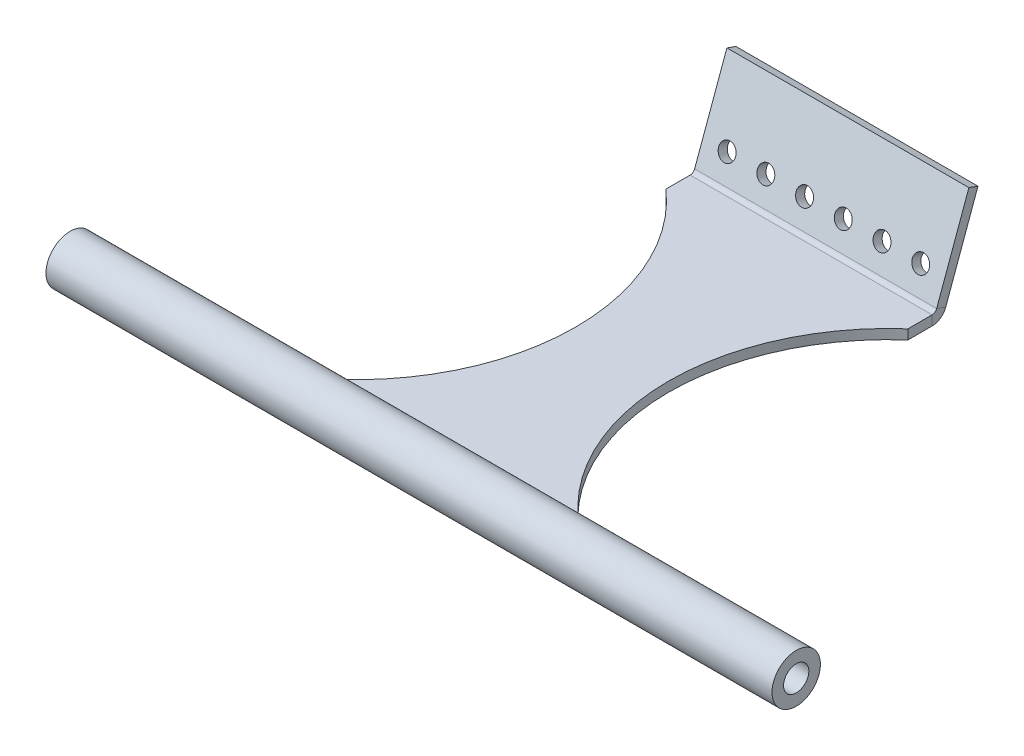
ISO-10303-21;
HEADER;
FILE_DESCRIPTION(('STEP AP214'),'2;1');
FILE_NAME('part.step','',(''),(''),'','','');
FILE_SCHEMA(('AUTOMOTIVE_DESIGN { 1 0 10303 214 1 1 1 1 }'));
ENDSEC;
DATA;
#1=APPLICATION_CONTEXT('core data for automotive mechanical design processes');
#2=APPLICATION_PROTOCOL_DEFINITION('international standard','automotive_design',2000,#1);
#3=PRODUCT_CONTEXT('',#1,'mechanical');
#4=PRODUCT('Part','Part','',(#3));
#5=PRODUCT_RELATED_PRODUCT_CATEGORY('part','',(#4));
#6=PRODUCT_DEFINITION_FORMATION('','',#4);
#7=PRODUCT_DEFINITION_CONTEXT('part definition',#1,'design');
#8=PRODUCT_DEFINITION('design','',#6,#7);
#9=PRODUCT_DEFINITION_SHAPE('','',#8);
#10=(LENGTH_UNIT() NAMED_UNIT(*) SI_UNIT(.MILLI.,.METRE.));
#11=(NAMED_UNIT(*) PLANE_ANGLE_UNIT() SI_UNIT($,.RADIAN.));
#12=(NAMED_UNIT(*) SI_UNIT($,.STERADIAN.) SOLID_ANGLE_UNIT());
#13=UNCERTAINTY_MEASURE_WITH_UNIT(LENGTH_MEASURE(1.E-05),#10,'distance_accuracy_value','');
#14=(GEOMETRIC_REPRESENTATION_CONTEXT(3) GLOBAL_UNCERTAINTY_ASSIGNED_CONTEXT((#13)) GLOBAL_UNIT_ASSIGNED_CONTEXT((#10,
#11,#12)) REPRESENTATION_CONTEXT('',''));
#15=CARTESIAN_POINT('',(0.,0.,0.));
#16=DIRECTION('',(0.,0.,1.));
#17=DIRECTION('',(1.,0.,0.));
#18=AXIS2_PLACEMENT_3D('',#15,#16,#17);
#19=CARTESIAN_POINT('',(25.,-2.,-50.));
#20=DIRECTION('',(1.,0.,0.));
#21=DIRECTION('',(0.,0.,-1.));
#22=AXIS2_PLACEMENT_3D('',#19,#20,#21);
#23=PLANE('',#22);
#24=CARTESIAN_POINT('',(25.,-1.,50.));
#25=DIRECTION('',(1.,0.,0.));
#26=DIRECTION('',(0.,0.,-1.));
#27=AXIS2_PLACEMENT_3D('',#24,#25,#26);
#28=CIRCLE('',#27,5.);
#29=CARTESIAN_POINT('',(25.,-1.,45.));
#30=VERTEX_POINT('',#29);
#31=CARTESIAN_POINT('',(25.,0.,45.1010205144336));
#32=VERTEX_POINT('',#31);
#33=EDGE_CURVE('E179',#30,#32,#28,.T.);
#34=ORIENTED_EDGE('',*,*,#33,.F.);
#35=DIRECTION('',(0.,-1.,0.));
#36=VECTOR('',#35,1.);
#37=CARTESIAN_POINT('',(25.,18.9625246801192,45.));
#38=LINE('',#37,#36);
#39=CARTESIAN_POINT('',(25.,0.,45.));
#40=VERTEX_POINT('',#39);
#41=EDGE_CURVE('E187',#40,#30,#38,.T.);
#42=ORIENTED_EDGE('',*,*,#41,.F.);
#43=DIRECTION('',(0.,0.,-1.));
#44=VECTOR('',#43,1.);
#45=CARTESIAN_POINT('',(25.,0.,-50.));
#46=LINE('',#45,#44);
#47=EDGE_CURVE('E217',#32,#40,#46,.T.);
#48=ORIENTED_EDGE('',*,*,#47,.F.);
#49=EDGE_LOOP('',(#34,#42,#48));
#50=FACE_BOUND('',#49,.T.);
#51=ADVANCED_FACE('F47',(#50),#23,.T.);
#52=CARTESIAN_POINT('',(-25.,-2.,-50.));
#53=DIRECTION('',(-1.,0.,0.));
#54=DIRECTION('',(0.,0.,1.));
#55=AXIS2_PLACEMENT_3D('',#52,#53,#54);
#56=PLANE('',#55);
#57=CARTESIAN_POINT('',(-25.,-1.,50.));
#58=DIRECTION('',(-1.,0.,0.));
#59=DIRECTION('',(0.,0.,1.));
#60=AXIS2_PLACEMENT_3D('',#57,#58,#59);
#61=CIRCLE('',#60,5.);
#62=CARTESIAN_POINT('',(-25.,0.,45.1010205144336));
#63=VERTEX_POINT('',#62);
#64=CARTESIAN_POINT('',(-25.,-1.,45.));
#65=VERTEX_POINT('',#64);
#66=EDGE_CURVE('E169',#63,#65,#61,.T.);
#67=ORIENTED_EDGE('',*,*,#66,.F.);
#68=DIRECTION('',(0.,0.,1.));
#69=VECTOR('',#68,1.);
#70=CARTESIAN_POINT('',(-25.,0.,-50.));
#71=LINE('',#70,#69);
#72=CARTESIAN_POINT('',(-25.,0.,45.));
#73=VERTEX_POINT('',#72);
#74=EDGE_CURVE('E213',#73,#63,#71,.T.);
#75=ORIENTED_EDGE('',*,*,#74,.F.);
#76=DIRECTION('',(0.,-1.,0.));
#77=VECTOR('',#76,1.);
#78=CARTESIAN_POINT('',(-25.,18.9625246801192,45.));
#79=LINE('',#78,#77);
#80=EDGE_CURVE('E252',#65,#73,#79,.F.);
#81=ORIENTED_EDGE('',*,*,#80,.F.);
#82=EDGE_LOOP('',(#67,#75,#81));
#83=FACE_BOUND('',#82,.T.);
#84=ADVANCED_FACE('F332',(#83),#56,.T.);
#85=CARTESIAN_POINT('',(25.,-2.,45.1010205144336));
#86=VERTEX_POINT('',#85);
#87=EDGE_CURVE('E64',#86,#30,#28,.T.);
#88=ORIENTED_EDGE('',*,*,#87,.F.);
#89=DIRECTION('',(0.,0.,-1.));
#90=VECTOR('',#89,1.);
#91=CARTESIAN_POINT('',(25.,-2.,-50.));
#92=LINE('',#91,#90);
#93=CARTESIAN_POINT('',(25.,-2.,45.));
#94=VERTEX_POINT('',#93);
#95=EDGE_CURVE('E163',#86,#94,#92,.T.);
#96=ORIENTED_EDGE('',*,*,#95,.T.);
#97=EDGE_CURVE('E190',#30,#94,#38,.T.);
#98=ORIENTED_EDGE('',*,*,#97,.F.);
#99=EDGE_LOOP('',(#88,#96,#98));
#100=FACE_BOUND('',#99,.T.);
#101=ADVANCED_FACE('F335',(#100),#23,.T.);
#102=DIRECTION('',(0.,-1.,0.));
#103=VECTOR('',#102,1.);
#104=CARTESIAN_POINT('',(-25.,18.9625246801192,-23.0772493108089));
#105=LINE('',#104,#103);
#106=CARTESIAN_POINT('',(-25.,0.,-23.0772493108089));
#107=VERTEX_POINT('',#106);
#108=CARTESIAN_POINT('',(-25.,-2.,-23.0772493108089));
#109=VERTEX_POINT('',#108);
#110=EDGE_CURVE('E56',#107,#109,#105,.T.);
#111=ORIENTED_EDGE('',*,*,#110,.F.);
#112=CARTESIAN_POINT('',(-25.,0.,-28.0772493108089));
#113=VERTEX_POINT('',#112);
#114=EDGE_CURVE('E210',#113,#107,#71,.T.);
#115=ORIENTED_EDGE('',*,*,#114,.F.);
#116=DIRECTION('',(0.,-1.,0.));
#117=VECTOR('',#116,1.);
#118=CARTESIAN_POINT('',(-25.,-2.,-28.0772493108089));
#119=LINE('',#118,#117);
#120=CARTESIAN_POINT('',(-25.,-2.,-28.0772493108089));
#121=VERTEX_POINT('',#120);
#122=EDGE_CURVE('E157',#113,#121,#119,.T.);
#123=ORIENTED_EDGE('',*,*,#122,.T.);
#124=DIRECTION('',(0.,0.,1.));
#125=VECTOR('',#124,1.);
#126=CARTESIAN_POINT('',(-25.,-2.,-50.));
#127=LINE('',#126,#125);
#128=EDGE_CURVE('E156',#121,#109,#127,.T.);
#129=ORIENTED_EDGE('',*,*,#128,.T.);
#130=EDGE_LOOP('',(#111,#115,#123,#129));
#131=FACE_BOUND('',#130,.T.);
#132=ADVANCED_FACE('F342',(#131),#56,.T.);
#133=CARTESIAN_POINT('',(0.,-28.7061466458276,-20.4576294744087));
#134=DIRECTION('',(0.,0.342020143325666,0.93969262078591));
#135=DIRECTION('',(0.,-0.93969262078591,0.342020143325666));
#136=AXIS2_PLACEMENT_3D('',#133,#134,#135);
#137=PLANE('',#136);
#138=CARTESIAN_POINT('',(20.,4.67240267395255,-32.606427889795));
#139=DIRECTION('',(0.,-0.342020143325666,-0.939692620785909));
#140=DIRECTION('',(0.,0.939692620785909,-0.342020143325666));
#141=AXIS2_PLACEMENT_3D('',#138,#139,#140);
#142=CIRCLE('',#141,1.75);
#143=CARTESIAN_POINT('',(20.,6.31686476032789,-33.2049631406149));
#144=VERTEX_POINT('',#143);
#145=EDGE_CURVE('E263',#144,#144,#142,.T.);
#146=ORIENTED_EDGE('',*,*,#145,.F.);
#147=EDGE_LOOP('',(#146));
#148=FACE_BOUND('',#147,.T.);
#149=CARTESIAN_POINT('',(12.,4.67240267395255,-32.606427889795));
#150=DIRECTION('',(0.,-0.342020143325666,-0.939692620785909));
#151=DIRECTION('',(0.,0.939692620785909,-0.342020143325666));
#152=AXIS2_PLACEMENT_3D('',#149,#150,#151);
#153=CIRCLE('',#152,1.75);
#154=CARTESIAN_POINT('',(12.,6.31686476032789,-33.2049631406149));
#155=VERTEX_POINT('',#154);
#156=EDGE_CURVE('E295',#155,#155,#153,.T.);
#157=ORIENTED_EDGE('',*,*,#156,.F.);
#158=EDGE_LOOP('',(#157));
#159=FACE_BOUND('',#158,.T.);
#160=CARTESIAN_POINT('',(3.99999999999999,4.67240267395255,-32.606427889795));
#161=DIRECTION('',(0.,-0.342020143325666,-0.939692620785909));
#162=DIRECTION('',(0.,0.939692620785909,-0.342020143325666));
#163=AXIS2_PLACEMENT_3D('',#160,#161,#162);
#164=CIRCLE('',#163,1.75);
#165=CARTESIAN_POINT('',(3.99999999999999,6.31686476032789,-33.2049631406149));
#166=VERTEX_POINT('',#165);
#167=EDGE_CURVE('E292',#166,#166,#164,.T.);
#168=ORIENTED_EDGE('',*,*,#167,.F.);
#169=EDGE_LOOP('',(#168));
#170=FACE_BOUND('',#169,.T.);
#171=CARTESIAN_POINT('',(-4.00000000000001,4.67240267395255,-32.606427889795));
#172=DIRECTION('',(0.,-0.342020143325666,-0.939692620785909));
#173=DIRECTION('',(0.,0.939692620785909,-0.342020143325666));
#174=AXIS2_PLACEMENT_3D('',#171,#172,#173);
#175=CIRCLE('',#174,1.75);
#176=CARTESIAN_POINT('',(-4.00000000000001,6.31686476032789,-33.2049631406149));
#177=VERTEX_POINT('',#176);
#178=EDGE_CURVE('E289',#177,#177,#175,.T.);
#179=ORIENTED_EDGE('',*,*,#178,.F.);
#180=EDGE_LOOP('',(#179));
#181=FACE_BOUND('',#180,.T.);
#182=CARTESIAN_POINT('',(-12.,4.67240267395255,-32.606427889795));
#183=DIRECTION('',(0.,-0.342020143325666,-0.939692620785909));
#184=DIRECTION('',(0.,0.939692620785909,-0.342020143325666));
#185=AXIS2_PLACEMENT_3D('',#182,#183,#184);
#186=CIRCLE('',#185,1.75);
#187=CARTESIAN_POINT('',(-12.,6.31686476032789,-33.2049631406149));
#188=VERTEX_POINT('',#187);
#189=EDGE_CURVE('E285',#188,#188,#186,.T.);
#190=ORIENTED_EDGE('',*,*,#189,.F.);
#191=EDGE_LOOP('',(#190));
#192=FACE_BOUND('',#191,.T.);
#193=CARTESIAN_POINT('',(-20.,4.67240267395255,-32.606427889795));
#194=DIRECTION('',(0.,-0.342020143325666,-0.939692620785909));
#195=DIRECTION('',(0.,0.939692620785909,-0.342020143325666));
#196=AXIS2_PLACEMENT_3D('',#193,#194,#195);
#197=CIRCLE('',#196,1.75);
#198=CARTESIAN_POINT('',(-20.,6.31686476032789,-33.2049631406149));
#199=VERTEX_POINT('',#198);
#200=EDGE_CURVE('E282',#199,#199,#197,.T.);
#201=ORIENTED_EDGE('',*,*,#200,.F.);
#202=EDGE_LOOP('',(#201));
#203=FACE_BOUND('',#202,.T.);
#204=DIRECTION('',(0.,0.93969262078591,-0.342020143325666));
#205=VECTOR('',#204,1.);
#206=CARTESIAN_POINT('',(25.,18.2784843934679,-37.558636640692));
#207=LINE('',#206,#205);
#208=CARTESIAN_POINT('',(25.,-0.0260604299769963,-30.8963271731667));
#209=VERTEX_POINT('',#208);
#210=CARTESIAN_POINT('',(25.,18.2784843934679,-37.558636640692));
#211=VERTEX_POINT('',#210);
#212=EDGE_CURVE('E230',#209,#211,#207,.T.);
#213=ORIENTED_EDGE('',*,*,#212,.F.);
#214=DIRECTION('',(-1.,0.,0.));
#215=VECTOR('',#214,1.);
#216=CARTESIAN_POINT('',(0.,-0.0260604299769963,-30.8963271731667));
#217=LINE('',#216,#215);
#218=CARTESIAN_POINT('',(-25.,-0.026060429976997,-30.8963271731667));
#219=VERTEX_POINT('',#218);
#220=EDGE_CURVE('E237',#209,#219,#217,.T.);
#221=ORIENTED_EDGE('',*,*,#220,.T.);
#222=DIRECTION('',(0.,-0.93969262078591,0.342020143325666));
#223=VECTOR('',#222,1.);
#224=CARTESIAN_POINT('',(-25.,18.2784843934679,-37.558636640692));
#225=LINE('',#224,#223);
#226=CARTESIAN_POINT('',(-25.,18.2784843934679,-37.558636640692));
#227=VERTEX_POINT('',#226);
#228=EDGE_CURVE('E229',#227,#219,#225,.T.);
#229=ORIENTED_EDGE('',*,*,#228,.F.);
#230=DIRECTION('',(-1.,0.,0.));
#231=VECTOR('',#230,1.);
#232=CARTESIAN_POINT('',(-25.,18.2784843934679,-37.558636640692));
#233=LINE('',#232,#231);
#234=EDGE_CURVE('E226',#211,#227,#233,.T.);
#235=ORIENTED_EDGE('',*,*,#234,.F.);
#236=EDGE_LOOP('',(#213,#221,#229,#235));
#237=FACE_BOUND('',#236,.T.);
#238=ADVANCED_FACE('F374',(#148,#159,#170,#181,#192,#203,#237),#137,.F.);
#239=CARTESIAN_POINT('',(25.,18.2784843934679,-37.558636640692));
#240=DIRECTION('',(1.,0.,0.));
#241=DIRECTION('',(0.,0.93969262078591,-0.342020143325666));
#242=AXIS2_PLACEMENT_3D('',#239,#240,#241);
#243=PLANE('',#242);
#244=DIRECTION('',(0.,0.342020143325666,0.93969262078591));
#245=VECTOR('',#244,1.);
#246=CARTESIAN_POINT('',(25.,-0.0260604299769963,-30.8963271731667));
#247=LINE('',#246,#245);
#248=CARTESIAN_POINT('',(25.,0.657979856674335,-29.0169419315948));
#249=VERTEX_POINT('',#248);
#250=EDGE_CURVE('E243',#209,#249,#247,.T.);
#251=ORIENTED_EDGE('',*,*,#250,.F.);
#252=ORIENTED_EDGE('',*,*,#212,.T.);
#253=DIRECTION('',(0.,0.342020143325666,0.93969262078591));
#254=VECTOR('',#253,1.);
#255=CARTESIAN_POINT('',(25.,18.2784843934679,-37.558636640692));
#256=LINE('',#255,#254);
#257=CARTESIAN_POINT('',(25.,18.9625246801192,-35.6792513991202));
#258=VERTEX_POINT('',#257);
#259=EDGE_CURVE('E238',#211,#258,#256,.T.);
#260=ORIENTED_EDGE('',*,*,#259,.T.);
#261=DIRECTION('',(0.,0.93969262078591,-0.342020143325666));
#262=VECTOR('',#261,1.);
#263=CARTESIAN_POINT('',(25.,18.9625246801192,-35.6792513991202));
#264=LINE('',#263,#262);
#265=EDGE_CURVE('E207',#249,#258,#264,.T.);
#266=ORIENTED_EDGE('',*,*,#265,.F.);
#267=EDGE_LOOP('',(#251,#252,#260,#266));
#268=FACE_BOUND('',#267,.T.);
#269=ADVANCED_FACE('F378',(#268),#243,.T.);
#270=CARTESIAN_POINT('',(-25.,18.2784843934679,-37.558636640692));
#271=DIRECTION('',(-1.,0.,0.));
#272=DIRECTION('',(0.,-0.93969262078591,0.342020143325666));
#273=AXIS2_PLACEMENT_3D('',#270,#271,#272);
#274=PLANE('',#273);
#275=DIRECTION('',(0.,-0.342020143325666,-0.93969262078591));
#276=VECTOR('',#275,1.);
#277=CARTESIAN_POINT('',(-25.,-0.0260604299769963,-30.8963271731667));
#278=LINE('',#277,#276);
#279=CARTESIAN_POINT('',(-25.,0.657979856674335,-29.0169419315948));
#280=VERTEX_POINT('',#279);
#281=EDGE_CURVE('E249',#280,#219,#278,.T.);
#282=ORIENTED_EDGE('',*,*,#281,.F.);
#283=DIRECTION('',(0.,-0.93969262078591,0.342020143325666));
#284=VECTOR('',#283,1.);
#285=CARTESIAN_POINT('',(-25.,18.9625246801192,-35.6792513991202));
#286=LINE('',#285,#284);
#287=CARTESIAN_POINT('',(-25.,18.9625246801192,-35.6792513991202));
#288=VERTEX_POINT('',#287);
#289=EDGE_CURVE('E234',#288,#280,#286,.T.);
#290=ORIENTED_EDGE('',*,*,#289,.F.);
#291=DIRECTION('',(0.,0.342020143325666,0.93969262078591));
#292=VECTOR('',#291,1.);
#293=CARTESIAN_POINT('',(-25.,18.2784843934679,-37.558636640692));
#294=LINE('',#293,#292);
#295=EDGE_CURVE('E235',#227,#288,#294,.T.);
#296=ORIENTED_EDGE('',*,*,#295,.F.);
#297=ORIENTED_EDGE('',*,*,#228,.T.);
#298=EDGE_LOOP('',(#282,#290,#296,#297));
#299=FACE_BOUND('',#298,.T.);
#300=ADVANCED_FACE('F49',(#299),#274,.T.);
#301=CARTESIAN_POINT('',(-25.,18.2784843934679,-37.558636640692));
#302=DIRECTION('',(0.,0.93969262078591,-0.342020143325666));
#303=DIRECTION('',(-1.,0.,0.));
#304=AXIS2_PLACEMENT_3D('',#301,#302,#303);
#305=PLANE('',#304);
#306=DIRECTION('',(-1.,0.,0.));
#307=VECTOR('',#306,1.);
#308=CARTESIAN_POINT('',(-25.,18.9625246801192,-35.6792513991202));
#309=LINE('',#308,#307);
#310=EDGE_CURVE('E231',#258,#288,#309,.T.);
#311=ORIENTED_EDGE('',*,*,#310,.F.);
#312=ORIENTED_EDGE('',*,*,#259,.F.);
#313=ORIENTED_EDGE('',*,*,#234,.T.);
#314=ORIENTED_EDGE('',*,*,#295,.T.);
#315=EDGE_LOOP('',(#311,#312,#313,#314));
#316=FACE_BOUND('',#315,.T.);
#317=ADVANCED_FACE('F424',(#316),#305,.T.);
#318=CARTESIAN_POINT('',(0.,-28.0221063591763,-18.5782442328369));
#319=DIRECTION('',(0.,0.342020143325666,0.93969262078591));
#320=DIRECTION('',(0.,-0.93969262078591,0.342020143325666));
#321=AXIS2_PLACEMENT_3D('',#318,#319,#320);
#322=PLANE('',#321);
#323=CARTESIAN_POINT('',(20.,5.35644296060388,-30.7270426482232));
#324=DIRECTION('',(0.,0.342020143325666,0.93969262078591));
#325=DIRECTION('',(0.,-0.939692620785909,0.342020143325666));
#326=AXIS2_PLACEMENT_3D('',#323,#324,#325);
#327=CIRCLE('',#326,1.75);
#328=CARTESIAN_POINT('',(20.,3.71198087422854,-30.1285073974033));
#329=VERTEX_POINT('',#328);
#330=EDGE_CURVE('E51',#329,#329,#327,.T.);
#331=ORIENTED_EDGE('',*,*,#330,.F.);
#332=EDGE_LOOP('',(#331));
#333=FACE_BOUND('',#332,.T.);
#334=CARTESIAN_POINT('',(12.,5.35644296060388,-30.7270426482232));
#335=DIRECTION('',(0.,0.342020143325666,0.93969262078591));
#336=DIRECTION('',(0.,-0.939692620785909,0.342020143325666));
#337=AXIS2_PLACEMENT_3D('',#334,#335,#336);
#338=CIRCLE('',#337,1.75);
#339=CARTESIAN_POINT('',(12.,3.71198087422854,-30.1285073974033));
#340=VERTEX_POINT('',#339);
#341=EDGE_CURVE('E271',#340,#340,#338,.T.);
#342=ORIENTED_EDGE('',*,*,#341,.F.);
#343=EDGE_LOOP('',(#342));
#344=FACE_BOUND('',#343,.T.);
#345=CARTESIAN_POINT('',(3.99999999999999,5.35644296060388,-30.7270426482232));
#346=DIRECTION('',(0.,0.342020143325666,0.93969262078591));
#347=DIRECTION('',(0.,-0.939692620785909,0.342020143325666));
#348=AXIS2_PLACEMENT_3D('',#345,#346,#347);
#349=CIRCLE('',#348,1.75);
#350=CARTESIAN_POINT('',(3.99999999999999,3.71198087422854,-30.1285073974033));
#351=VERTEX_POINT('',#350);
#352=EDGE_CURVE('E269',#351,#351,#349,.T.);
#353=ORIENTED_EDGE('',*,*,#352,.F.);
#354=EDGE_LOOP('',(#353));
#355=FACE_BOUND('',#354,.T.);
#356=CARTESIAN_POINT('',(-4.00000000000001,5.35644296060388,-30.7270426482232));
#357=DIRECTION('',(0.,0.342020143325666,0.93969262078591));
#358=DIRECTION('',(0.,-0.939692620785909,0.342020143325666));
#359=AXIS2_PLACEMENT_3D('',#356,#357,#358);
#360=CIRCLE('',#359,1.75);
#361=CARTESIAN_POINT('',(-4.00000000000001,3.71198087422854,-30.1285073974033));
#362=VERTEX_POINT('',#361);
#363=EDGE_CURVE('E266',#362,#362,#360,.T.);
#364=ORIENTED_EDGE('',*,*,#363,.F.);
#365=EDGE_LOOP('',(#364));
#366=FACE_BOUND('',#365,.T.);
#367=CARTESIAN_POINT('',(-12.,5.35644296060389,-30.7270426482232));
#368=DIRECTION('',(0.,0.342020143325666,0.93969262078591));
#369=DIRECTION('',(0.,-0.939692620785909,0.342020143325666));
#370=AXIS2_PLACEMENT_3D('',#367,#368,#369);
#371=CIRCLE('',#370,1.75);
#372=CARTESIAN_POINT('',(-12.,3.71198087422855,-30.1285073974033));
#373=VERTEX_POINT('',#372);
#374=EDGE_CURVE('E262',#373,#373,#371,.T.);
#375=ORIENTED_EDGE('',*,*,#374,.F.);
#376=EDGE_LOOP('',(#375));
#377=FACE_BOUND('',#376,.T.);
#378=CARTESIAN_POINT('',(-20.,5.35644296060389,-30.7270426482232));
#379=DIRECTION('',(0.,0.342020143325666,0.93969262078591));
#380=DIRECTION('',(0.,-0.939692620785909,0.342020143325666));
#381=AXIS2_PLACEMENT_3D('',#378,#379,#380);
#382=CIRCLE('',#381,1.75);
#383=CARTESIAN_POINT('',(-20.,3.71198087422855,-30.1285073974033));
#384=VERTEX_POINT('',#383);
#385=EDGE_CURVE('E259',#384,#384,#382,.T.);
#386=ORIENTED_EDGE('',*,*,#385,.F.);
#387=EDGE_LOOP('',(#386));
#388=FACE_BOUND('',#387,.T.);
#389=DIRECTION('',(-1.,0.,0.));
#390=VECTOR('',#389,1.);
#391=CARTESIAN_POINT('',(0.,0.657979856674335,-29.0169419315948));
#392=LINE('',#391,#390);
#393=EDGE_CURVE('E246',#249,#280,#392,.T.);
#394=ORIENTED_EDGE('',*,*,#393,.F.);
#395=ORIENTED_EDGE('',*,*,#265,.T.);
#396=ORIENTED_EDGE('',*,*,#310,.T.);
#397=ORIENTED_EDGE('',*,*,#289,.T.);
#398=EDGE_LOOP('',(#394,#395,#396,#397));
#399=FACE_BOUND('',#398,.T.);
#400=ADVANCED_FACE('F353',(#333,#344,#355,#366,#377,#388,#399),#322,.T.);
#401=CARTESIAN_POINT('',(0.,-2.,0.));
#402=DIRECTION('',(0.,1.,0.));
#403=DIRECTION('',(0.,0.,1.));
#404=AXIS2_PLACEMENT_3D('',#401,#402,#403);
#405=PLANE('',#404);
#406=ORIENTED_EDGE('',*,*,#95,.F.);
#407=DIRECTION('',(1.,0.,0.));
#408=VECTOR('',#407,1.);
#409=CARTESIAN_POINT('',(-75.,-2.,45.1010205144336));
#410=LINE('',#409,#408);
#411=CARTESIAN_POINT('',(-25.,-2.,45.1010205144336));
#412=VERTEX_POINT('',#411);
#413=EDGE_CURVE('E160',#86,#412,#410,.F.);
#414=ORIENTED_EDGE('',*,*,#413,.T.);
#415=CARTESIAN_POINT('',(-25.,-2.,45.));
#416=VERTEX_POINT('',#415);
#417=EDGE_CURVE('E146',#416,#412,#127,.T.);
#418=ORIENTED_EDGE('',*,*,#417,.F.);
#419=CARTESIAN_POINT('',(-55.,-2.,10.9613753445955));
#420=DIRECTION('',(0.,-1.,0.));
#421=DIRECTION('',(0.,0.,1.));
#422=AXIS2_PLACEMENT_3D('',#419,#420,#421);
#423=CIRCLE('',#422,45.3721056204306);
#424=EDGE_CURVE('E180',#109,#416,#423,.T.);
#425=ORIENTED_EDGE('',*,*,#424,.F.);
#426=ORIENTED_EDGE('',*,*,#128,.F.);
#427=DIRECTION('',(-1.,0.,0.));
#428=VECTOR('',#427,1.);
#429=CARTESIAN_POINT('',(0.,-2.,-28.0772493108089));
#430=LINE('',#429,#428);
#431=CARTESIAN_POINT('',(25.,-2.,-28.0772493108089));
#432=VERTEX_POINT('',#431);
#433=EDGE_CURVE('E201',#432,#121,#430,.T.);
#434=ORIENTED_EDGE('',*,*,#433,.F.);
#435=CARTESIAN_POINT('',(25.,-2.,-23.0772493108089));
#436=VERTEX_POINT('',#435);
#437=EDGE_CURVE('E224',#436,#432,#92,.T.);
#438=ORIENTED_EDGE('',*,*,#437,.F.);
#439=CARTESIAN_POINT('',(55.,-2.,10.9613753445955));
#440=DIRECTION('',(0.,-1.,0.));
#441=DIRECTION('',(0.,0.,-1.));
#442=AXIS2_PLACEMENT_3D('',#439,#440,#441);
#443=CIRCLE('',#442,45.3721056204306);
#444=EDGE_CURVE('E183',#94,#436,#443,.T.);
#445=ORIENTED_EDGE('',*,*,#444,.F.);
#446=EDGE_LOOP('',(#406,#414,#418,#425,#426,#434,#438,#445));
#447=FACE_BOUND('',#446,.T.);
#448=ADVANCED_FACE('F161',(#447),#405,.F.);
#449=DIRECTION('',(0.,-1.,0.));
#450=VECTOR('',#449,1.);
#451=CARTESIAN_POINT('',(25.,18.9625246801192,-23.0772493108089));
#452=LINE('',#451,#450);
#453=CARTESIAN_POINT('',(25.,0.,-23.0772493108089));
#454=VERTEX_POINT('',#453);
#455=EDGE_CURVE('E184',#454,#436,#452,.T.);
#456=ORIENTED_EDGE('',*,*,#455,.T.);
#457=ORIENTED_EDGE('',*,*,#437,.T.);
#458=DIRECTION('',(0.,1.,0.));
#459=VECTOR('',#458,1.);
#460=CARTESIAN_POINT('',(25.,-2.,-28.0772493108089));
#461=LINE('',#460,#459);
#462=CARTESIAN_POINT('',(25.,0.,-28.0772493108089));
#463=VERTEX_POINT('',#462);
#464=EDGE_CURVE('E220',#432,#463,#461,.T.);
#465=ORIENTED_EDGE('',*,*,#464,.T.);
#466=EDGE_CURVE('E219',#454,#463,#46,.T.);
#467=ORIENTED_EDGE('',*,*,#466,.F.);
#468=EDGE_LOOP('',(#456,#457,#465,#467));
#469=FACE_BOUND('',#468,.T.);
#470=ADVANCED_FACE('F336',(#469),#23,.T.);
#471=CARTESIAN_POINT('',(0.,0.,0.));
#472=DIRECTION('',(0.,1.,0.));
#473=DIRECTION('',(0.,0.,1.));
#474=AXIS2_PLACEMENT_3D('',#471,#472,#473);
#475=PLANE('',#474);
#476=DIRECTION('',(1.,0.,0.));
#477=VECTOR('',#476,1.);
#478=CARTESIAN_POINT('',(-75.,0.,45.1010205144336));
#479=LINE('',#478,#477);
#480=EDGE_CURVE('E72',#32,#63,#479,.F.);
#481=ORIENTED_EDGE('',*,*,#480,.F.);
#482=ORIENTED_EDGE('',*,*,#47,.T.);
#483=CARTESIAN_POINT('',(55.,0.,10.9613753445955));
#484=DIRECTION('',(0.,1.,0.));
#485=DIRECTION('',(0.,0.,1.));
#486=AXIS2_PLACEMENT_3D('',#483,#484,#485);
#487=CIRCLE('',#486,45.3721056204306);
#488=EDGE_CURVE('E12',#454,#40,#487,.T.);
#489=ORIENTED_EDGE('',*,*,#488,.F.);
#490=ORIENTED_EDGE('',*,*,#466,.T.);
#491=DIRECTION('',(-1.,0.,0.));
#492=VECTOR('',#491,1.);
#493=CARTESIAN_POINT('',(0.,0.,-28.0772493108089));
#494=LINE('',#493,#492);
#495=EDGE_CURVE('E214',#463,#113,#494,.T.);
#496=ORIENTED_EDGE('',*,*,#495,.T.);
#497=ORIENTED_EDGE('',*,*,#114,.T.);
#498=CARTESIAN_POINT('',(-55.,0.,10.9613753445955));
#499=DIRECTION('',(0.,1.,0.));
#500=DIRECTION('',(0.,0.,1.));
#501=AXIS2_PLACEMENT_3D('',#498,#499,#500);
#502=CIRCLE('',#501,45.3721056204306);
#503=EDGE_CURVE('E182',#73,#107,#502,.T.);
#504=ORIENTED_EDGE('',*,*,#503,.F.);
#505=ORIENTED_EDGE('',*,*,#74,.T.);
#506=EDGE_LOOP('',(#481,#482,#489,#490,#496,#497,#504,#505));
#507=FACE_BOUND('',#506,.T.);
#508=ADVANCED_FACE('F347',(#507),#475,.T.);
#509=EDGE_CURVE('E150',#65,#412,#61,.T.);
#510=ORIENTED_EDGE('',*,*,#509,.F.);
#511=EDGE_CURVE('E153',#416,#65,#79,.F.);
#512=ORIENTED_EDGE('',*,*,#511,.F.);
#513=ORIENTED_EDGE('',*,*,#417,.T.);
#514=EDGE_LOOP('',(#510,#512,#513));
#515=FACE_BOUND('',#514,.T.);
#516=ADVANCED_FACE('F148',(#515),#56,.T.);
#517=CARTESIAN_POINT('',(25.,1.,-28.0772493108089));
#518=DIRECTION('',(1.,0.,0.));
#519=DIRECTION('',(0.,0.,-1.));
#520=AXIS2_PLACEMENT_3D('',#517,#518,#519);
#521=PLANE('',#520);
#522=ORIENTED_EDGE('',*,*,#250,.T.);
#523=CARTESIAN_POINT('',(25.,1.,-28.0772493108089));
#524=DIRECTION('',(1.,0.,0.));
#525=DIRECTION('',(0.,0.,-1.));
#526=AXIS2_PLACEMENT_3D('',#523,#524,#525);
#527=CIRCLE('',#526,1.);
#528=EDGE_CURVE('E193',#249,#463,#527,.F.);
#529=ORIENTED_EDGE('',*,*,#528,.T.);
#530=ORIENTED_EDGE('',*,*,#464,.F.);
#531=CARTESIAN_POINT('',(25.,1.,-28.0772493108089));
#532=DIRECTION('',(-1.,0.,0.));
#533=DIRECTION('',(0.,0.,-1.));
#534=AXIS2_PLACEMENT_3D('',#531,#532,#533);
#535=CIRCLE('',#534,3.);
#536=EDGE_CURVE('E194',#209,#432,#535,.T.);
#537=ORIENTED_EDGE('',*,*,#536,.F.);
#538=EDGE_LOOP('',(#522,#529,#530,#537));
#539=FACE_BOUND('',#538,.T.);
#540=ADVANCED_FACE('F382',(#539),#521,.T.);
#541=CARTESIAN_POINT('',(-25.,1.,-28.0772493108089));
#542=DIRECTION('',(-1.,0.,0.));
#543=DIRECTION('',(0.,0.,1.));
#544=AXIS2_PLACEMENT_3D('',#541,#542,#543);
#545=PLANE('',#544);
#546=ORIENTED_EDGE('',*,*,#122,.F.);
#547=CARTESIAN_POINT('',(-25.,1.,-28.0772493108089));
#548=DIRECTION('',(1.,0.,0.));
#549=DIRECTION('',(0.,0.,-1.));
#550=AXIS2_PLACEMENT_3D('',#547,#548,#549);
#551=CIRCLE('',#550,1.);
#552=EDGE_CURVE('E198',#113,#280,#551,.T.);
#553=ORIENTED_EDGE('',*,*,#552,.T.);
#554=ORIENTED_EDGE('',*,*,#281,.T.);
#555=CARTESIAN_POINT('',(-25.,1.,-28.0772493108089));
#556=DIRECTION('',(1.,0.,0.));
#557=DIRECTION('',(0.,0.,1.));
#558=AXIS2_PLACEMENT_3D('',#555,#556,#557);
#559=CIRCLE('',#558,3.);
#560=EDGE_CURVE('E197',#121,#219,#559,.T.);
#561=ORIENTED_EDGE('',*,*,#560,.F.);
#562=EDGE_LOOP('',(#546,#553,#554,#561));
#563=FACE_BOUND('',#562,.T.);
#564=ADVANCED_FACE('F366',(#563),#545,.T.);
#565=CARTESIAN_POINT('',(-50.099605801122,1.,-28.0772493108089));
#566=DIRECTION('',(1.,0.,0.));
#567=DIRECTION('',(0.,0.,-1.));
#568=AXIS2_PLACEMENT_3D('',#565,#566,#567);
#569=CYLINDRICAL_SURFACE('',#568,3.);
#570=ORIENTED_EDGE('',*,*,#560,.T.);
#571=ORIENTED_EDGE('',*,*,#220,.F.);
#572=ORIENTED_EDGE('',*,*,#536,.T.);
#573=ORIENTED_EDGE('',*,*,#433,.T.);
#574=EDGE_LOOP('',(#570,#571,#572,#573));
#575=FACE_BOUND('',#574,.T.);
#576=ADVANCED_FACE('F362',(#575),#569,.T.);
#577=CARTESIAN_POINT('',(-50.099605801122,1.,-28.0772493108089));
#578=DIRECTION('',(1.,0.,0.));
#579=DIRECTION('',(0.,0.,-1.));
#580=AXIS2_PLACEMENT_3D('',#577,#578,#579);
#581=CYLINDRICAL_SURFACE('',#580,1.);
#582=ORIENTED_EDGE('',*,*,#552,.F.);
#583=ORIENTED_EDGE('',*,*,#495,.F.);
#584=ORIENTED_EDGE('',*,*,#528,.F.);
#585=ORIENTED_EDGE('',*,*,#393,.T.);
#586=EDGE_LOOP('',(#582,#583,#584,#585));
#587=FACE_BOUND('',#586,.T.);
#588=ADVANCED_FACE('F385',(#587),#581,.F.);
#589=CARTESIAN_POINT('',(-55.,18.9625246801192,10.9613753445955));
#590=DIRECTION('',(0.,-1.,0.));
#591=DIRECTION('',(0.,0.,-1.));
#592=AXIS2_PLACEMENT_3D('',#589,#590,#591);
#593=CYLINDRICAL_SURFACE('',#592,45.3721056204306);
#594=ORIENTED_EDGE('',*,*,#503,.T.);
#595=ORIENTED_EDGE('',*,*,#110,.T.);
#596=ORIENTED_EDGE('',*,*,#424,.T.);
#597=ORIENTED_EDGE('',*,*,#511,.T.);
#598=ORIENTED_EDGE('',*,*,#80,.T.);
#599=EDGE_LOOP('',(#594,#595,#596,#597,#598));
#600=FACE_BOUND('',#599,.T.);
#601=ADVANCED_FACE('F327',(#600),#593,.F.);
#602=CARTESIAN_POINT('',(55.,18.9625246801192,10.9613753445955));
#603=DIRECTION('',(0.,-1.,0.));
#604=DIRECTION('',(0.,0.,-1.));
#605=AXIS2_PLACEMENT_3D('',#602,#603,#604);
#606=CYLINDRICAL_SURFACE('',#605,45.3721056204306);
#607=ORIENTED_EDGE('',*,*,#488,.T.);
#608=ORIENTED_EDGE('',*,*,#41,.T.);
#609=ORIENTED_EDGE('',*,*,#97,.T.);
#610=ORIENTED_EDGE('',*,*,#444,.T.);
#611=ORIENTED_EDGE('',*,*,#455,.F.);
#612=EDGE_LOOP('',(#607,#608,#609,#610,#611));
#613=FACE_BOUND('',#612,.T.);
#614=ADVANCED_FACE('F322',(#613),#606,.F.);
#615=CARTESIAN_POINT('',(-75.,-1.,50.));
#616=DIRECTION('',(1.,0.,0.));
#617=DIRECTION('',(0.,0.,-1.));
#618=AXIS2_PLACEMENT_3D('',#615,#616,#617);
#619=CYLINDRICAL_SURFACE('',#618,5.);
#620=ORIENTED_EDGE('',*,*,#87,.T.);
#621=ORIENTED_EDGE('',*,*,#33,.T.);
#622=ORIENTED_EDGE('',*,*,#480,.T.);
#623=ORIENTED_EDGE('',*,*,#66,.T.);
#624=ORIENTED_EDGE('',*,*,#509,.T.);
#625=ORIENTED_EDGE('',*,*,#413,.F.);
#626=EDGE_LOOP('',(#620,#621,#622,#623,#624,#625));
#627=FACE_BOUND('',#626,.T.);
#628=CARTESIAN_POINT('',(-75.,-1.,50.));
#629=DIRECTION('',(1.,0.,0.));
#630=DIRECTION('',(0.,0.,-1.));
#631=AXIS2_PLACEMENT_3D('',#628,#629,#630);
#632=CIRCLE('',#631,5.);
#633=CARTESIAN_POINT('',(-75.,-1.,45.));
#634=VERTEX_POINT('',#633);
#635=EDGE_CURVE('E170',#634,#634,#632,.T.);
#636=ORIENTED_EDGE('',*,*,#635,.T.);
#637=EDGE_LOOP('',(#636));
#638=FACE_BOUND('',#637,.T.);
#639=CARTESIAN_POINT('',(75.,-1.,50.));
#640=DIRECTION('',(1.,0.,0.));
#641=DIRECTION('',(0.,0.,-1.));
#642=AXIS2_PLACEMENT_3D('',#639,#640,#641);
#643=CIRCLE('',#642,5.);
#644=CARTESIAN_POINT('',(75.,-1.,45.));
#645=VERTEX_POINT('',#644);
#646=EDGE_CURVE('E173',#645,#645,#643,.T.);
#647=ORIENTED_EDGE('',*,*,#646,.F.);
#648=EDGE_LOOP('',(#647));
#649=FACE_BOUND('',#648,.T.);
#650=ADVANCED_FACE('F167',(#627,#638,#649),#619,.T.);
#651=CARTESIAN_POINT('',(-75.,-1.,50.));
#652=DIRECTION('',(1.,0.,0.));
#653=DIRECTION('',(0.,0.,-1.));
#654=AXIS2_PLACEMENT_3D('',#651,#652,#653);
#655=PLANE('',#654);
#656=CARTESIAN_POINT('',(-75.,-1.,50.));
#657=DIRECTION('',(-1.,0.,0.));
#658=DIRECTION('',(0.,0.,1.));
#659=AXIS2_PLACEMENT_3D('',#656,#657,#658);
#660=CIRCLE('',#659,2.61136213997501);
#661=CARTESIAN_POINT('',(-75.,-1.,52.611362139975));
#662=VERTEX_POINT('',#661);
#663=EDGE_CURVE('E300',#662,#662,#660,.T.);
#664=ORIENTED_EDGE('',*,*,#663,.F.);
#665=EDGE_LOOP('',(#664));
#666=FACE_BOUND('',#665,.T.);
#667=ORIENTED_EDGE('',*,*,#635,.F.);
#668=EDGE_LOOP('',(#667));
#669=FACE_BOUND('',#668,.T.);
#670=ADVANCED_FACE('F315',(#666,#669),#655,.F.);
#671=CARTESIAN_POINT('',(75.,-1.,50.));
#672=DIRECTION('',(1.,0.,0.));
#673=DIRECTION('',(0.,0.,-1.));
#674=AXIS2_PLACEMENT_3D('',#671,#672,#673);
#675=PLANE('',#674);
#676=CARTESIAN_POINT('',(75.,-1.,50.));
#677=DIRECTION('',(-1.,0.,0.));
#678=DIRECTION('',(0.,0.,1.));
#679=AXIS2_PLACEMENT_3D('',#676,#677,#678);
#680=CIRCLE('',#679,2.61136213997501);
#681=CARTESIAN_POINT('',(75.,-1.,52.611362139975));
#682=VERTEX_POINT('',#681);
#683=EDGE_CURVE('E286',#682,#682,#680,.T.);
#684=ORIENTED_EDGE('',*,*,#683,.T.);
#685=EDGE_LOOP('',(#684));
#686=FACE_BOUND('',#685,.T.);
#687=ORIENTED_EDGE('',*,*,#646,.T.);
#688=EDGE_LOOP('',(#687));
#689=FACE_BOUND('',#688,.T.);
#690=ADVANCED_FACE('F306',(#686,#689),#675,.T.);
#691=CARTESIAN_POINT('',(-20.,34.5001925881063,49.3447513715795));
#692=DIRECTION('',(0.,-0.342020143325666,-0.939692620785909));
#693=DIRECTION('',(0.,0.939692620785909,-0.342020143325666));
#694=AXIS2_PLACEMENT_3D('',#691,#692,#693);
#695=CYLINDRICAL_SURFACE('',#694,1.75);
#696=ORIENTED_EDGE('',*,*,#385,.T.);
#697=EDGE_LOOP('',(#696));
#698=FACE_BOUND('',#697,.T.);
#699=ORIENTED_EDGE('',*,*,#200,.T.);
#700=EDGE_LOOP('',(#699));
#701=FACE_BOUND('',#700,.T.);
#702=ADVANCED_FACE('F443',(#698,#701),#695,.F.);
#703=CARTESIAN_POINT('',(-12.,34.5001925881063,49.3447513715795));
#704=DIRECTION('',(0.,-0.342020143325666,-0.939692620785909));
#705=DIRECTION('',(0.,0.939692620785909,-0.342020143325666));
#706=AXIS2_PLACEMENT_3D('',#703,#704,#705);
#707=CYLINDRICAL_SURFACE('',#706,1.75);
#708=ORIENTED_EDGE('',*,*,#374,.T.);
#709=EDGE_LOOP('',(#708));
#710=FACE_BOUND('',#709,.T.);
#711=ORIENTED_EDGE('',*,*,#189,.T.);
#712=EDGE_LOOP('',(#711));
#713=FACE_BOUND('',#712,.T.);
#714=ADVANCED_FACE('F446',(#710,#713),#707,.F.);
#715=CARTESIAN_POINT('',(-4.00000000000002,34.5001925881063,49.3447513715795));
#716=DIRECTION('',(0.,-0.342020143325666,-0.939692620785909));
#717=DIRECTION('',(0.,0.939692620785909,-0.342020143325666));
#718=AXIS2_PLACEMENT_3D('',#715,#716,#717);
#719=CYLINDRICAL_SURFACE('',#718,1.75);
#720=ORIENTED_EDGE('',*,*,#363,.T.);
#721=EDGE_LOOP('',(#720));
#722=FACE_BOUND('',#721,.T.);
#723=ORIENTED_EDGE('',*,*,#178,.T.);
#724=EDGE_LOOP('',(#723));
#725=FACE_BOUND('',#724,.T.);
#726=ADVANCED_FACE('F454',(#722,#725),#719,.F.);
#727=CARTESIAN_POINT('',(3.99999999999998,34.5001925881063,49.3447513715795));
#728=DIRECTION('',(0.,-0.342020143325666,-0.939692620785909));
#729=DIRECTION('',(0.,0.939692620785909,-0.342020143325666));
#730=AXIS2_PLACEMENT_3D('',#727,#728,#729);
#731=CYLINDRICAL_SURFACE('',#730,1.75);
#732=ORIENTED_EDGE('',*,*,#352,.T.);
#733=EDGE_LOOP('',(#732));
#734=FACE_BOUND('',#733,.T.);
#735=ORIENTED_EDGE('',*,*,#167,.T.);
#736=EDGE_LOOP('',(#735));
#737=FACE_BOUND('',#736,.T.);
#738=ADVANCED_FACE('F461',(#734,#737),#731,.F.);
#739=CARTESIAN_POINT('',(12.,34.5001925881063,49.3447513715795));
#740=DIRECTION('',(0.,-0.342020143325666,-0.939692620785909));
#741=DIRECTION('',(0.,0.939692620785909,-0.342020143325666));
#742=AXIS2_PLACEMENT_3D('',#739,#740,#741);
#743=CYLINDRICAL_SURFACE('',#742,1.75);
#744=ORIENTED_EDGE('',*,*,#341,.T.);
#745=EDGE_LOOP('',(#744));
#746=FACE_BOUND('',#745,.T.);
#747=ORIENTED_EDGE('',*,*,#156,.T.);
#748=EDGE_LOOP('',(#747));
#749=FACE_BOUND('',#748,.T.);
#750=ADVANCED_FACE('F465',(#746,#749),#743,.F.);
#751=CARTESIAN_POINT('',(20.,34.5001925881063,49.3447513715795));
#752=DIRECTION('',(0.,-0.342020143325666,-0.939692620785909));
#753=DIRECTION('',(0.,0.939692620785909,-0.342020143325666));
#754=AXIS2_PLACEMENT_3D('',#751,#752,#753);
#755=CYLINDRICAL_SURFACE('',#754,1.75);
#756=ORIENTED_EDGE('',*,*,#330,.T.);
#757=EDGE_LOOP('',(#756));
#758=FACE_BOUND('',#757,.T.);
#759=ORIENTED_EDGE('',*,*,#145,.T.);
#760=EDGE_LOOP('',(#759));
#761=FACE_BOUND('',#760,.T.);
#762=ADVANCED_FACE('F311',(#758,#761),#755,.F.);
#763=CARTESIAN_POINT('',(75.,-1.,50.));
#764=DIRECTION('',(-1.,0.,0.));
#765=DIRECTION('',(0.,0.,1.));
#766=AXIS2_PLACEMENT_3D('',#763,#764,#765);
#767=CYLINDRICAL_SURFACE('',#766,2.61136213997501);
#768=ORIENTED_EDGE('',*,*,#683,.F.);
#769=EDGE_LOOP('',(#768));
#770=FACE_BOUND('',#769,.T.);
#771=ORIENTED_EDGE('',*,*,#663,.T.);
#772=EDGE_LOOP('',(#771));
#773=FACE_BOUND('',#772,.T.);
#774=ADVANCED_FACE('F308',(#770,#773),#767,.F.);
#775=CLOSED_SHELL('',(#51,#84,#101,#132,#238,#269,#300,#317,#400,#448,#470,#508,#516,#540,#564,
#576,#588,#601,#614,#650,#670,#690,#702,#714,#726,#738,#750,#762,#774));
#776=MANIFOLD_SOLID_BREP('B2',#775);
#777=ADVANCED_BREP_SHAPE_REPRESENTATION('',(#18,#776),#14);
#778=SHAPE_DEFINITION_REPRESENTATION(#9,#777);
ENDSEC;
END-ISO-10303-21;
